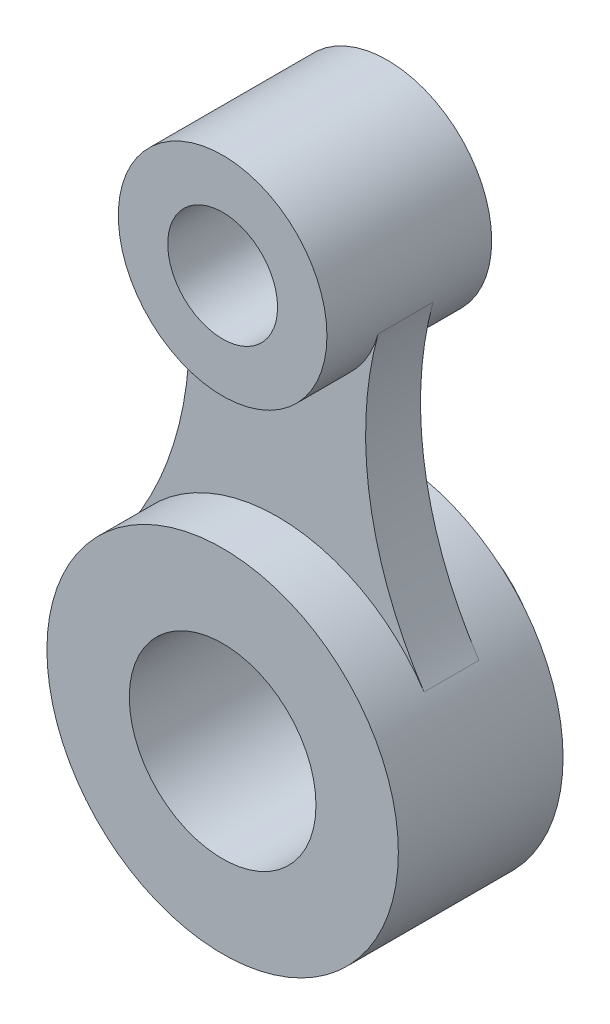
ISO-10303-21;
HEADER;
FILE_DESCRIPTION(('STEP AP214'),'2;1');
FILE_NAME('part.step','',(''),(''),'','','');
FILE_SCHEMA(('AUTOMOTIVE_DESIGN { 1 0 10303 214 1 1 1 1 }'));
ENDSEC;
DATA;
#1=APPLICATION_CONTEXT('core data for automotive mechanical design processes');
#2=APPLICATION_PROTOCOL_DEFINITION('international standard','automotive_design',2000,#1);
#3=PRODUCT_CONTEXT('',#1,'mechanical');
#4=PRODUCT('Part','Part','',(#3));
#5=PRODUCT_RELATED_PRODUCT_CATEGORY('part','',(#4));
#6=PRODUCT_DEFINITION_FORMATION('','',#4);
#7=PRODUCT_DEFINITION_CONTEXT('part definition',#1,'design');
#8=PRODUCT_DEFINITION('design','',#6,#7);
#9=PRODUCT_DEFINITION_SHAPE('','',#8);
#10=(LENGTH_UNIT() NAMED_UNIT(*) SI_UNIT(.MILLI.,.METRE.));
#11=(NAMED_UNIT(*) PLANE_ANGLE_UNIT() SI_UNIT($,.RADIAN.));
#12=(NAMED_UNIT(*) SI_UNIT($,.STERADIAN.) SOLID_ANGLE_UNIT());
#13=UNCERTAINTY_MEASURE_WITH_UNIT(LENGTH_MEASURE(1.E-05),#10,'distance_accuracy_value','');
#14=(GEOMETRIC_REPRESENTATION_CONTEXT(3) GLOBAL_UNCERTAINTY_ASSIGNED_CONTEXT((#13)) GLOBAL_UNIT_ASSIGNED_CONTEXT((#10,
#11,#12)) REPRESENTATION_CONTEXT('',''));
#15=CARTESIAN_POINT('',(0.,0.,0.));
#16=DIRECTION('',(0.,0.,1.));
#17=DIRECTION('',(1.,0.,0.));
#18=AXIS2_PLACEMENT_3D('',#15,#16,#17);
#19=CARTESIAN_POINT('',(0.,0.,15.));
#20=DIRECTION('',(0.,0.,1.));
#21=DIRECTION('',(1.,0.,0.));
#22=AXIS2_PLACEMENT_3D('',#19,#20,#21);
#23=PLANE('',#22);
#24=CARTESIAN_POINT('',(0.,0.,15.));
#25=DIRECTION('',(0.,0.,1.));
#26=DIRECTION('',(1.,0.,0.));
#27=AXIS2_PLACEMENT_3D('',#24,#25,#26);
#28=CIRCLE('',#27,32.);
#29=CARTESIAN_POINT('',(32.,0.,15.));
#30=VERTEX_POINT('',#29);
#31=EDGE_CURVE('E11',#30,#30,#28,.T.);
#32=ORIENTED_EDGE('',*,*,#31,.T.);
#33=EDGE_LOOP('',(#32));
#34=FACE_BOUND('',#33,.T.);
#35=CARTESIAN_POINT('',(0.,0.,15.));
#36=DIRECTION('',(0.,0.,1.));
#37=DIRECTION('',(1.,0.,0.));
#38=AXIS2_PLACEMENT_3D('',#35,#36,#37);
#39=CIRCLE('',#38,17.);
#40=CARTESIAN_POINT('',(17.,0.,15.));
#41=VERTEX_POINT('',#40);
#42=EDGE_CURVE('E124',#41,#41,#39,.T.);
#43=ORIENTED_EDGE('',*,*,#42,.F.);
#44=EDGE_LOOP('',(#43));
#45=FACE_BOUND('',#44,.T.);
#46=ADVANCED_FACE('F49',(#34,#45),#23,.T.);
#47=CARTESIAN_POINT('',(0.,0.,-15.));
#48=DIRECTION('',(0.,0.,1.));
#49=DIRECTION('',(1.,0.,0.));
#50=AXIS2_PLACEMENT_3D('',#47,#48,#49);
#51=PLANE('',#50);
#52=CARTESIAN_POINT('',(0.,0.,-15.));
#53=DIRECTION('',(0.,0.,-1.));
#54=DIRECTION('',(-1.,0.,0.));
#55=AXIS2_PLACEMENT_3D('',#52,#53,#54);
#56=CIRCLE('',#55,27.5);
#57=CARTESIAN_POINT('',(-27.5,0.,-15.));
#58=VERTEX_POINT('',#57);
#59=EDGE_CURVE('E203',#58,#58,#56,.T.);
#60=ORIENTED_EDGE('',*,*,#59,.F.);
#61=EDGE_LOOP('',(#60));
#62=FACE_BOUND('',#61,.T.);
#63=CARTESIAN_POINT('',(0.,0.,-15.));
#64=DIRECTION('',(0.,0.,1.));
#65=DIRECTION('',(1.,0.,0.));
#66=AXIS2_PLACEMENT_3D('',#63,#64,#65);
#67=CIRCLE('',#66,32.);
#68=CARTESIAN_POINT('',(32.,0.,-15.));
#69=VERTEX_POINT('',#68);
#70=EDGE_CURVE('E53',#69,#69,#67,.T.);
#71=ORIENTED_EDGE('',*,*,#70,.F.);
#72=EDGE_LOOP('',(#71));
#73=FACE_BOUND('',#72,.T.);
#74=ADVANCED_FACE('F132',(#62,#73),#51,.F.);
#75=CARTESIAN_POINT('',(0.,0.,15.));
#76=DIRECTION('',(0.,0.,-1.));
#77=DIRECTION('',(-1.,0.,0.));
#78=AXIS2_PLACEMENT_3D('',#75,#76,#77);
#79=CYLINDRICAL_SURFACE('',#78,32.);
#80=DIRECTION('',(0.,0.,-1.));
#81=VECTOR('',#80,1.);
#82=CARTESIAN_POINT('',(26.6783026465097,17.6711111111111,5.));
#83=LINE('',#82,#81);
#84=CARTESIAN_POINT('',(26.6783026465097,17.6711111111111,5.));
#85=VERTEX_POINT('',#84);
#86=CARTESIAN_POINT('',(26.6783026465097,17.6711111111111,-5.));
#87=VERTEX_POINT('',#86);
#88=EDGE_CURVE('E64',#85,#87,#83,.T.);
#89=ORIENTED_EDGE('',*,*,#88,.F.);
#90=CARTESIAN_POINT('',(0.,0.,5.));
#91=DIRECTION('',(0.,0.,-1.));
#92=DIRECTION('',(1.,0.,0.));
#93=AXIS2_PLACEMENT_3D('',#90,#91,#92);
#94=CIRCLE('',#93,32.);
#95=CARTESIAN_POINT('',(-26.6783026465097,17.6711111111111,5.));
#96=VERTEX_POINT('',#95);
#97=EDGE_CURVE('E68',#96,#85,#94,.T.);
#98=ORIENTED_EDGE('',*,*,#97,.F.);
#99=DIRECTION('',(0.,0.,-1.));
#100=VECTOR('',#99,1.);
#101=CARTESIAN_POINT('',(-26.6783026465097,17.6711111111111,5.));
#102=LINE('',#101,#100);
#103=CARTESIAN_POINT('',(-26.6783026465097,17.6711111111111,-5.));
#104=VERTEX_POINT('',#103);
#105=EDGE_CURVE('E107',#96,#104,#102,.T.);
#106=ORIENTED_EDGE('',*,*,#105,.T.);
#107=CARTESIAN_POINT('',(0.,0.,-5.));
#108=DIRECTION('',(0.,0.,-1.));
#109=DIRECTION('',(1.,0.,0.));
#110=AXIS2_PLACEMENT_3D('',#107,#108,#109);
#111=CIRCLE('',#110,32.);
#112=EDGE_CURVE('E95',#104,#87,#111,.T.);
#113=ORIENTED_EDGE('',*,*,#112,.T.);
#114=EDGE_LOOP('',(#89,#98,#106,#113));
#115=FACE_BOUND('',#114,.T.);
#116=ORIENTED_EDGE('',*,*,#31,.F.);
#117=EDGE_LOOP('',(#116));
#118=FACE_BOUND('',#117,.T.);
#119=ORIENTED_EDGE('',*,*,#70,.T.);
#120=EDGE_LOOP('',(#119));
#121=FACE_BOUND('',#120,.T.);
#122=ADVANCED_FACE('F51',(#115,#118,#121),#79,.T.);
#123=CARTESIAN_POINT('',(0.,0.,15.));
#124=DIRECTION('',(0.,0.,-1.));
#125=DIRECTION('',(-1.,0.,0.));
#126=AXIS2_PLACEMENT_3D('',#123,#124,#125);
#127=CYLINDRICAL_SURFACE('',#126,17.);
#128=ORIENTED_EDGE('',*,*,#42,.T.);
#129=EDGE_LOOP('',(#128));
#130=FACE_BOUND('',#129,.T.);
#131=CARTESIAN_POINT('',(0.,0.,-22.5));
#132=DIRECTION('',(0.,0.,-1.));
#133=DIRECTION('',(-1.,0.,0.));
#134=AXIS2_PLACEMENT_3D('',#131,#132,#133);
#135=CIRCLE('',#134,17.);
#136=CARTESIAN_POINT('',(-17.,0.,-22.5));
#137=VERTEX_POINT('',#136);
#138=EDGE_CURVE('E195',#137,#137,#135,.T.);
#139=ORIENTED_EDGE('',*,*,#138,.T.);
#140=EDGE_LOOP('',(#139));
#141=FACE_BOUND('',#140,.T.);
#142=ADVANCED_FACE('F139',(#130,#141),#127,.F.);
#143=CARTESIAN_POINT('',(80.034907939529,53.0133333333333,5.));
#144=DIRECTION('',(0.,0.,-1.));
#145=DIRECTION('',(-1.,0.,0.));
#146=AXIS2_PLACEMENT_3D('',#143,#144,#145);
#147=CYLINDRICAL_SURFACE('',#146,64.);
#148=CARTESIAN_POINT('',(80.034907939529,53.0133333333333,-5.));
#149=DIRECTION('',(0.,0.,-1.));
#150=DIRECTION('',(1.,0.,0.));
#151=AXIS2_PLACEMENT_3D('',#148,#149,#150);
#152=CIRCLE('',#151,64.);
#153=CARTESIAN_POINT('',(18.3212439861572,69.9669076305221,-5.));
#154=VERTEX_POINT('',#153);
#155=EDGE_CURVE('E113',#87,#154,#152,.T.);
#156=ORIENTED_EDGE('',*,*,#155,.T.);
#157=DIRECTION('',(0.,0.,-1.));
#158=VECTOR('',#157,1.);
#159=CARTESIAN_POINT('',(18.3212439861572,69.9669076305221,5.));
#160=LINE('',#159,#158);
#161=CARTESIAN_POINT('',(18.3212439861572,69.9669076305221,5.));
#162=VERTEX_POINT('',#161);
#163=EDGE_CURVE('E106',#162,#154,#160,.T.);
#164=ORIENTED_EDGE('',*,*,#163,.F.);
#165=CARTESIAN_POINT('',(80.034907939529,53.0133333333333,5.));
#166=DIRECTION('',(0.,0.,-1.));
#167=DIRECTION('',(1.,0.,0.));
#168=AXIS2_PLACEMENT_3D('',#165,#166,#167);
#169=CIRCLE('',#168,64.);
#170=EDGE_CURVE('E120',#85,#162,#169,.T.);
#171=ORIENTED_EDGE('',*,*,#170,.F.);
#172=ORIENTED_EDGE('',*,*,#88,.T.);
#173=EDGE_LOOP('',(#156,#164,#171,#172));
#174=FACE_BOUND('',#173,.T.);
#175=ADVANCED_FACE('F146',(#174),#147,.F.);
#176=CARTESIAN_POINT('',(-80.034907939529,53.0133333333333,5.));
#177=DIRECTION('',(0.,0.,-1.));
#178=DIRECTION('',(-1.,0.,0.));
#179=AXIS2_PLACEMENT_3D('',#176,#177,#178);
#180=CYLINDRICAL_SURFACE('',#179,64.);
#181=CARTESIAN_POINT('',(-80.034907939529,53.0133333333333,-5.));
#182=DIRECTION('',(0.,0.,-1.));
#183=DIRECTION('',(1.,0.,0.));
#184=AXIS2_PLACEMENT_3D('',#181,#182,#183);
#185=CIRCLE('',#184,64.);
#186=CARTESIAN_POINT('',(-18.3212439861572,69.9669076305221,-5.));
#187=VERTEX_POINT('',#186);
#188=EDGE_CURVE('E88',#187,#104,#185,.T.);
#189=ORIENTED_EDGE('',*,*,#188,.T.);
#190=ORIENTED_EDGE('',*,*,#105,.F.);
#191=CARTESIAN_POINT('',(-80.034907939529,53.0133333333333,5.));
#192=DIRECTION('',(0.,0.,-1.));
#193=DIRECTION('',(1.,0.,0.));
#194=AXIS2_PLACEMENT_3D('',#191,#192,#193);
#195=CIRCLE('',#194,64.);
#196=CARTESIAN_POINT('',(-18.3212439861573,69.9669076305221,5.));
#197=VERTEX_POINT('',#196);
#198=EDGE_CURVE('E103',#197,#96,#195,.T.);
#199=ORIENTED_EDGE('',*,*,#198,.F.);
#200=DIRECTION('',(0.,0.,-1.));
#201=VECTOR('',#200,1.);
#202=CARTESIAN_POINT('',(-18.3212439861573,69.9669076305221,5.));
#203=LINE('',#202,#201);
#204=EDGE_CURVE('E101',#197,#187,#203,.T.);
#205=ORIENTED_EDGE('',*,*,#204,.T.);
#206=EDGE_LOOP('',(#189,#190,#199,#205));
#207=FACE_BOUND('',#206,.T.);
#208=ADVANCED_FACE('F102',(#207),#180,.F.);
#209=CARTESIAN_POINT('',(40.0174539697645,26.5066666666667,5.));
#210=DIRECTION('',(0.,0.,1.));
#211=DIRECTION('',(1.,0.,0.));
#212=AXIS2_PLACEMENT_3D('',#209,#210,#211);
#213=PLANE('',#212);
#214=ORIENTED_EDGE('',*,*,#170,.T.);
#215=CARTESIAN_POINT('',(0.,75.,5.));
#216=DIRECTION('',(0.,0.,-1.));
#217=DIRECTION('',(1.,0.,0.));
#218=AXIS2_PLACEMENT_3D('',#215,#216,#217);
#219=CIRCLE('',#218,19.);
#220=EDGE_CURVE('E221',#162,#197,#219,.T.);
#221=ORIENTED_EDGE('',*,*,#220,.T.);
#222=ORIENTED_EDGE('',*,*,#198,.T.);
#223=ORIENTED_EDGE('',*,*,#97,.T.);
#224=EDGE_LOOP('',(#214,#221,#222,#223));
#225=FACE_BOUND('',#224,.T.);
#226=ADVANCED_FACE('F152',(#225),#213,.T.);
#227=CARTESIAN_POINT('',(40.0174539697645,26.5066666666667,-5.));
#228=DIRECTION('',(0.,0.,1.));
#229=DIRECTION('',(1.,0.,0.));
#230=AXIS2_PLACEMENT_3D('',#227,#228,#229);
#231=PLANE('',#230);
#232=ORIENTED_EDGE('',*,*,#155,.F.);
#233=ORIENTED_EDGE('',*,*,#112,.F.);
#234=ORIENTED_EDGE('',*,*,#188,.F.);
#235=CARTESIAN_POINT('',(0.,75.,-5.));
#236=DIRECTION('',(0.,0.,-1.));
#237=DIRECTION('',(1.,0.,0.));
#238=AXIS2_PLACEMENT_3D('',#235,#236,#237);
#239=CIRCLE('',#238,19.);
#240=EDGE_CURVE('E93',#154,#187,#239,.T.);
#241=ORIENTED_EDGE('',*,*,#240,.F.);
#242=EDGE_LOOP('',(#232,#233,#234,#241));
#243=FACE_BOUND('',#242,.T.);
#244=ADVANCED_FACE('F91',(#243),#231,.F.);
#245=CARTESIAN_POINT('',(0.,75.,15.));
#246=DIRECTION('',(0.,0.,1.));
#247=DIRECTION('',(1.,0.,0.));
#248=AXIS2_PLACEMENT_3D('',#245,#246,#247);
#249=PLANE('',#248);
#250=CARTESIAN_POINT('',(0.,75.,15.));
#251=DIRECTION('',(0.,0.,1.));
#252=DIRECTION('',(1.,0.,0.));
#253=AXIS2_PLACEMENT_3D('',#250,#251,#252);
#254=CIRCLE('',#253,19.);
#255=CARTESIAN_POINT('',(19.,75.,15.));
#256=VERTEX_POINT('',#255);
#257=EDGE_CURVE('E207',#256,#256,#254,.T.);
#258=ORIENTED_EDGE('',*,*,#257,.T.);
#259=EDGE_LOOP('',(#258));
#260=FACE_BOUND('',#259,.T.);
#261=CARTESIAN_POINT('',(0.,75.,15.));
#262=DIRECTION('',(0.,0.,1.));
#263=DIRECTION('',(1.,0.,0.));
#264=AXIS2_PLACEMENT_3D('',#261,#262,#263);
#265=CIRCLE('',#264,10.);
#266=CARTESIAN_POINT('',(10.,75.,15.));
#267=VERTEX_POINT('',#266);
#268=EDGE_CURVE('E213',#267,#267,#265,.T.);
#269=ORIENTED_EDGE('',*,*,#268,.F.);
#270=EDGE_LOOP('',(#269));
#271=FACE_BOUND('',#270,.T.);
#272=ADVANCED_FACE('F155',(#260,#271),#249,.T.);
#273=CARTESIAN_POINT('',(0.,75.,-15.));
#274=DIRECTION('',(0.,0.,1.));
#275=DIRECTION('',(1.,0.,0.));
#276=AXIS2_PLACEMENT_3D('',#273,#274,#275);
#277=PLANE('',#276);
#278=CARTESIAN_POINT('',(0.,75.,-15.));
#279=DIRECTION('',(0.,0.,1.));
#280=DIRECTION('',(1.,0.,0.));
#281=AXIS2_PLACEMENT_3D('',#278,#279,#280);
#282=CIRCLE('',#281,19.);
#283=CARTESIAN_POINT('',(19.,75.,-15.));
#284=VERTEX_POINT('',#283);
#285=EDGE_CURVE('E210',#284,#284,#282,.T.);
#286=ORIENTED_EDGE('',*,*,#285,.F.);
#287=EDGE_LOOP('',(#286));
#288=FACE_BOUND('',#287,.T.);
#289=CARTESIAN_POINT('',(0.,75.,-15.));
#290=DIRECTION('',(0.,0.,1.));
#291=DIRECTION('',(1.,0.,0.));
#292=AXIS2_PLACEMENT_3D('',#289,#290,#291);
#293=CIRCLE('',#292,10.);
#294=CARTESIAN_POINT('',(10.,75.,-15.));
#295=VERTEX_POINT('',#294);
#296=EDGE_CURVE('E115',#295,#295,#293,.T.);
#297=ORIENTED_EDGE('',*,*,#296,.T.);
#298=EDGE_LOOP('',(#297));
#299=FACE_BOUND('',#298,.T.);
#300=ADVANCED_FACE('F166',(#288,#299),#277,.F.);
#301=CARTESIAN_POINT('',(0.,75.,15.));
#302=DIRECTION('',(0.,0.,-1.));
#303=DIRECTION('',(-1.,0.,0.));
#304=AXIS2_PLACEMENT_3D('',#301,#302,#303);
#305=CYLINDRICAL_SURFACE('',#304,19.);
#306=ORIENTED_EDGE('',*,*,#220,.F.);
#307=ORIENTED_EDGE('',*,*,#163,.T.);
#308=ORIENTED_EDGE('',*,*,#240,.T.);
#309=ORIENTED_EDGE('',*,*,#204,.F.);
#310=EDGE_LOOP('',(#306,#307,#308,#309));
#311=FACE_BOUND('',#310,.T.);
#312=ORIENTED_EDGE('',*,*,#257,.F.);
#313=EDGE_LOOP('',(#312));
#314=FACE_BOUND('',#313,.T.);
#315=ORIENTED_EDGE('',*,*,#285,.T.);
#316=EDGE_LOOP('',(#315));
#317=FACE_BOUND('',#316,.T.);
#318=ADVANCED_FACE('F110',(#311,#314,#317),#305,.T.);
#319=CARTESIAN_POINT('',(0.,75.,15.));
#320=DIRECTION('',(0.,0.,-1.));
#321=DIRECTION('',(-1.,0.,0.));
#322=AXIS2_PLACEMENT_3D('',#319,#320,#321);
#323=CYLINDRICAL_SURFACE('',#322,10.);
#324=ORIENTED_EDGE('',*,*,#268,.T.);
#325=EDGE_LOOP('',(#324));
#326=FACE_BOUND('',#325,.T.);
#327=ORIENTED_EDGE('',*,*,#296,.F.);
#328=EDGE_LOOP('',(#327));
#329=FACE_BOUND('',#328,.T.);
#330=ADVANCED_FACE('F159',(#326,#329),#323,.F.);
#331=CARTESIAN_POINT('',(0.,0.,-10.));
#332=DIRECTION('',(0.,0.,-1.));
#333=DIRECTION('',(-1.,0.,0.));
#334=AXIS2_PLACEMENT_3D('',#331,#332,#333);
#335=CYLINDRICAL_SURFACE('',#334,27.5);
#336=CARTESIAN_POINT('',(0.,0.,-10.));
#337=DIRECTION('',(0.,0.,-1.));
#338=DIRECTION('',(-1.,0.,0.));
#339=AXIS2_PLACEMENT_3D('',#336,#337,#338);
#340=CIRCLE('',#339,27.5);
#341=CARTESIAN_POINT('',(-27.5,0.,-10.));
#342=VERTEX_POINT('',#341);
#343=EDGE_CURVE('E204',#342,#342,#340,.T.);
#344=ORIENTED_EDGE('',*,*,#343,.F.);
#345=EDGE_LOOP('',(#344));
#346=FACE_BOUND('',#345,.T.);
#347=ORIENTED_EDGE('',*,*,#59,.T.);
#348=EDGE_LOOP('',(#347));
#349=FACE_BOUND('',#348,.T.);
#350=ADVANCED_FACE('F162',(#346,#349),#335,.F.);
#351=CARTESIAN_POINT('',(0.,0.,-10.));
#352=DIRECTION('',(0.,0.,-1.));
#353=DIRECTION('',(-1.,0.,0.));
#354=AXIS2_PLACEMENT_3D('',#351,#352,#353);
#355=PLANE('',#354);
#356=CARTESIAN_POINT('',(0.,0.,-10.));
#357=DIRECTION('',(0.,0.,-1.));
#358=DIRECTION('',(-1.,0.,0.));
#359=AXIS2_PLACEMENT_3D('',#356,#357,#358);
#360=CIRCLE('',#359,21.5);
#361=CARTESIAN_POINT('',(-21.5,0.,-10.));
#362=VERTEX_POINT('',#361);
#363=EDGE_CURVE('E198',#362,#362,#360,.T.);
#364=ORIENTED_EDGE('',*,*,#363,.F.);
#365=EDGE_LOOP('',(#364));
#366=FACE_BOUND('',#365,.T.);
#367=ORIENTED_EDGE('',*,*,#343,.T.);
#368=EDGE_LOOP('',(#367));
#369=FACE_BOUND('',#368,.T.);
#370=ADVANCED_FACE('F175',(#366,#369),#355,.T.);
#371=CARTESIAN_POINT('',(0.,0.,-10.));
#372=DIRECTION('',(0.,0.,-1.));
#373=DIRECTION('',(-1.,0.,0.));
#374=AXIS2_PLACEMENT_3D('',#371,#372,#373);
#375=CYLINDRICAL_SURFACE('',#374,21.5);
#376=ORIENTED_EDGE('',*,*,#363,.T.);
#377=EDGE_LOOP('',(#376));
#378=FACE_BOUND('',#377,.T.);
#379=CARTESIAN_POINT('',(0.,0.,-22.5));
#380=DIRECTION('',(0.,0.,-1.));
#381=DIRECTION('',(-1.,0.,0.));
#382=AXIS2_PLACEMENT_3D('',#379,#380,#381);
#383=CIRCLE('',#382,21.5);
#384=CARTESIAN_POINT('',(-21.5,0.,-22.5));
#385=VERTEX_POINT('',#384);
#386=EDGE_CURVE('E192',#385,#385,#383,.T.);
#387=ORIENTED_EDGE('',*,*,#386,.F.);
#388=EDGE_LOOP('',(#387));
#389=FACE_BOUND('',#388,.T.);
#390=ADVANCED_FACE('F179',(#378,#389),#375,.T.);
#391=CARTESIAN_POINT('',(0.,0.,-22.5));
#392=DIRECTION('',(0.,0.,-1.));
#393=DIRECTION('',(-1.,0.,0.));
#394=AXIS2_PLACEMENT_3D('',#391,#392,#393);
#395=PLANE('',#394);
#396=ORIENTED_EDGE('',*,*,#386,.T.);
#397=EDGE_LOOP('',(#396));
#398=FACE_BOUND('',#397,.T.);
#399=ORIENTED_EDGE('',*,*,#138,.F.);
#400=EDGE_LOOP('',(#399));
#401=FACE_BOUND('',#400,.T.);
#402=ADVANCED_FACE('F183',(#398,#401),#395,.T.);
#403=CLOSED_SHELL('',(#46,#74,#122,#142,#175,#208,#226,#244,#272,#300,#318,#330,#350,#370,#390,#402));
#404=MANIFOLD_SOLID_BREP('B2',#403);
#405=ADVANCED_BREP_SHAPE_REPRESENTATION('',(#18,#404),#14);
#406=SHAPE_DEFINITION_REPRESENTATION(#9,#405);
ENDSEC;
END-ISO-10303-21;
